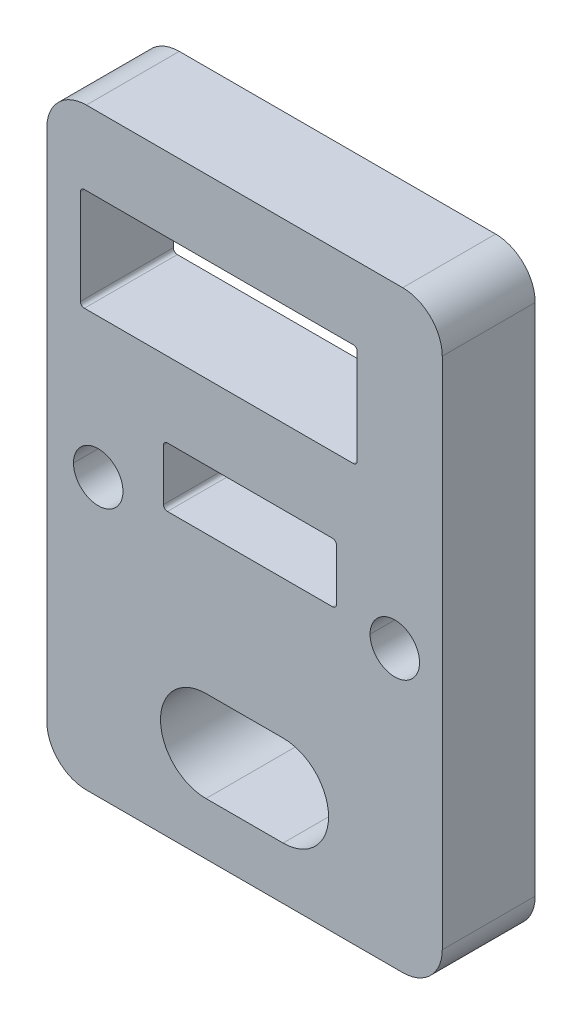
ISO-10303-21;
HEADER;
FILE_DESCRIPTION(('STEP AP214'),'2;1');
FILE_NAME('part.step','',(''),(''),'','','');
FILE_SCHEMA(('AUTOMOTIVE_DESIGN { 1 0 10303 214 1 1 1 1 }'));
ENDSEC;
DATA;
#1=APPLICATION_CONTEXT('core data for automotive mechanical design processes');
#2=APPLICATION_PROTOCOL_DEFINITION('international standard','automotive_design',2000,#1);
#3=PRODUCT_CONTEXT('',#1,'mechanical');
#4=PRODUCT('Part','Part','',(#3));
#5=PRODUCT_RELATED_PRODUCT_CATEGORY('part','',(#4));
#6=PRODUCT_DEFINITION_FORMATION('','',#4);
#7=PRODUCT_DEFINITION_CONTEXT('part definition',#1,'design');
#8=PRODUCT_DEFINITION('design','',#6,#7);
#9=PRODUCT_DEFINITION_SHAPE('','',#8);
#10=(LENGTH_UNIT() NAMED_UNIT(*) SI_UNIT(.MILLI.,.METRE.));
#11=(NAMED_UNIT(*) PLANE_ANGLE_UNIT() SI_UNIT($,.RADIAN.));
#12=(NAMED_UNIT(*) SI_UNIT($,.STERADIAN.) SOLID_ANGLE_UNIT());
#13=UNCERTAINTY_MEASURE_WITH_UNIT(LENGTH_MEASURE(1.E-05),#10,'distance_accuracy_value','');
#14=(GEOMETRIC_REPRESENTATION_CONTEXT(3) GLOBAL_UNCERTAINTY_ASSIGNED_CONTEXT((#13)) GLOBAL_UNIT_ASSIGNED_CONTEXT((#10,
#11,#12)) REPRESENTATION_CONTEXT('',''));
#15=CARTESIAN_POINT('',(0.,0.,0.));
#16=DIRECTION('',(0.,0.,1.));
#17=DIRECTION('',(1.,0.,0.));
#18=AXIS2_PLACEMENT_3D('',#15,#16,#17);
#19=CARTESIAN_POINT('',(18.5,-6.,-4.7));
#20=DIRECTION('',(0.,0.,-1.));
#21=DIRECTION('',(-1.,0.,0.));
#22=AXIS2_PLACEMENT_3D('',#19,#20,#21);
#23=CYLINDRICAL_SURFACE('',#22,2.);
#24=CARTESIAN_POINT('',(18.5,-6.,-4.7));
#25=DIRECTION('',(0.,0.,-1.));
#26=DIRECTION('',(-1.,0.,0.));
#27=AXIS2_PLACEMENT_3D('',#24,#25,#26);
#28=CIRCLE('',#27,2.);
#29=CARTESIAN_POINT('',(20.5,-6.,-4.7));
#30=VERTEX_POINT('',#29);
#31=CARTESIAN_POINT('',(18.5,-8.,-4.7));
#32=VERTEX_POINT('',#31);
#33=EDGE_CURVE('E493',#30,#32,#28,.T.);
#34=ORIENTED_EDGE('',*,*,#33,.F.);
#35=DIRECTION('',(0.,0.,-1.));
#36=VECTOR('',#35,1.);
#37=CARTESIAN_POINT('',(20.5,-6.,-4.7));
#38=LINE('',#37,#36);
#39=CARTESIAN_POINT('',(20.5,-6.,0.));
#40=VERTEX_POINT('',#39);
#41=EDGE_CURVE('E606',#40,#30,#38,.T.);
#42=ORIENTED_EDGE('',*,*,#41,.F.);
#43=CARTESIAN_POINT('',(18.5,-6.,0.));
#44=DIRECTION('',(0.,0.,1.));
#45=DIRECTION('',(-1.,0.,0.));
#46=AXIS2_PLACEMENT_3D('',#43,#44,#45);
#47=CIRCLE('',#46,2.);
#48=CARTESIAN_POINT('',(18.5,-8.,0.));
#49=VERTEX_POINT('',#48);
#50=EDGE_CURVE('E363',#49,#40,#47,.T.);
#51=ORIENTED_EDGE('',*,*,#50,.F.);
#52=DIRECTION('',(0.,0.,1.));
#53=VECTOR('',#52,1.);
#54=CARTESIAN_POINT('',(18.5,-8.,0.));
#55=LINE('',#54,#53);
#56=EDGE_CURVE('E342',#32,#49,#55,.T.);
#57=ORIENTED_EDGE('',*,*,#56,.F.);
#58=EDGE_LOOP('',(#34,#42,#51,#57));
#59=FACE_BOUND('',#58,.T.);
#60=ADVANCED_FACE('F17',(#59),#23,.T.);
#61=CARTESIAN_POINT('',(18.5,20.,-4.7));
#62=DIRECTION('',(0.,0.,1.));
#63=DIRECTION('',(1.,0.,0.));
#64=AXIS2_PLACEMENT_3D('',#61,#62,#63);
#65=CYLINDRICAL_SURFACE('',#64,2.);
#66=CARTESIAN_POINT('',(18.5,20.,-4.7));
#67=DIRECTION('',(0.,0.,-1.));
#68=DIRECTION('',(-1.,0.,0.));
#69=AXIS2_PLACEMENT_3D('',#66,#67,#68);
#70=CIRCLE('',#69,2.);
#71=CARTESIAN_POINT('',(18.5,22.,-4.7));
#72=VERTEX_POINT('',#71);
#73=CARTESIAN_POINT('',(20.5,20.,-4.7));
#74=VERTEX_POINT('',#73);
#75=EDGE_CURVE('E499',#72,#74,#70,.T.);
#76=ORIENTED_EDGE('',*,*,#75,.F.);
#77=DIRECTION('',(0.,0.,-1.));
#78=VECTOR('',#77,1.);
#79=CARTESIAN_POINT('',(18.5,22.,-4.7));
#80=LINE('',#79,#78);
#81=CARTESIAN_POINT('',(18.5,22.,0.));
#82=VERTEX_POINT('',#81);
#83=EDGE_CURVE('E637',#82,#72,#80,.T.);
#84=ORIENTED_EDGE('',*,*,#83,.F.);
#85=CARTESIAN_POINT('',(18.5,20.,0.));
#86=DIRECTION('',(0.,0.,1.));
#87=DIRECTION('',(-1.,0.,0.));
#88=AXIS2_PLACEMENT_3D('',#85,#86,#87);
#89=CIRCLE('',#88,2.);
#90=CARTESIAN_POINT('',(20.5,20.,0.));
#91=VERTEX_POINT('',#90);
#92=EDGE_CURVE('E357',#91,#82,#89,.T.);
#93=ORIENTED_EDGE('',*,*,#92,.F.);
#94=DIRECTION('',(0.,0.,1.));
#95=VECTOR('',#94,1.);
#96=CARTESIAN_POINT('',(20.5,20.,-4.7));
#97=LINE('',#96,#95);
#98=EDGE_CURVE('E627',#74,#91,#97,.T.);
#99=ORIENTED_EDGE('',*,*,#98,.F.);
#100=EDGE_LOOP('',(#76,#84,#93,#99));
#101=FACE_BOUND('',#100,.T.);
#102=ADVANCED_FACE('F628',(#101),#65,.T.);
#103=CARTESIAN_POINT('',(2.5,-6.,-4.7));
#104=DIRECTION('',(0.,0.,1.));
#105=DIRECTION('',(1.,0.,0.));
#106=AXIS2_PLACEMENT_3D('',#103,#104,#105);
#107=CYLINDRICAL_SURFACE('',#106,2.);
#108=CARTESIAN_POINT('',(2.5,-6.,-4.7));
#109=DIRECTION('',(0.,0.,-1.));
#110=DIRECTION('',(-1.,0.,0.));
#111=AXIS2_PLACEMENT_3D('',#108,#109,#110);
#112=CIRCLE('',#111,2.);
#113=CARTESIAN_POINT('',(2.5,-8.,-4.7));
#114=VERTEX_POINT('',#113);
#115=CARTESIAN_POINT('',(0.500000000000006,-6.,-4.7));
#116=VERTEX_POINT('',#115);
#117=EDGE_CURVE('E484',#114,#116,#112,.T.);
#118=ORIENTED_EDGE('',*,*,#117,.F.);
#119=DIRECTION('',(0.,0.,-1.));
#120=VECTOR('',#119,1.);
#121=CARTESIAN_POINT('',(2.5,-8.,-4.7));
#122=LINE('',#121,#120);
#123=CARTESIAN_POINT('',(2.5,-8.,0.));
#124=VERTEX_POINT('',#123);
#125=EDGE_CURVE('E20',#124,#114,#122,.T.);
#126=ORIENTED_EDGE('',*,*,#125,.F.);
#127=CARTESIAN_POINT('',(2.5,-6.,0.));
#128=DIRECTION('',(0.,0.,1.));
#129=DIRECTION('',(-1.,0.,0.));
#130=AXIS2_PLACEMENT_3D('',#127,#128,#129);
#131=CIRCLE('',#130,2.);
#132=CARTESIAN_POINT('',(0.500000000000006,-6.,0.));
#133=VERTEX_POINT('',#132);
#134=EDGE_CURVE('E523',#133,#124,#131,.T.);
#135=ORIENTED_EDGE('',*,*,#134,.F.);
#136=DIRECTION('',(0.,0.,1.));
#137=VECTOR('',#136,1.);
#138=CARTESIAN_POINT('',(0.500000000000006,-6.,-4.7));
#139=LINE('',#138,#137);
#140=EDGE_CURVE('E460',#116,#133,#139,.T.);
#141=ORIENTED_EDGE('',*,*,#140,.F.);
#142=EDGE_LOOP('',(#118,#126,#135,#141));
#143=FACE_BOUND('',#142,.T.);
#144=ADVANCED_FACE('F485',(#143),#107,.T.);
#145=CARTESIAN_POINT('',(2.5,20.,-4.7));
#146=DIRECTION('',(0.,0.,-1.));
#147=DIRECTION('',(-1.,0.,0.));
#148=AXIS2_PLACEMENT_3D('',#145,#146,#147);
#149=CYLINDRICAL_SURFACE('',#148,2.);
#150=CARTESIAN_POINT('',(2.5,20.,-4.7));
#151=DIRECTION('',(0.,0.,-1.));
#152=DIRECTION('',(-1.,0.,0.));
#153=AXIS2_PLACEMENT_3D('',#150,#151,#152);
#154=CIRCLE('',#153,2.);
#155=CARTESIAN_POINT('',(0.500000000000006,20.,-4.7));
#156=VERTEX_POINT('',#155);
#157=CARTESIAN_POINT('',(2.5,22.,-4.7));
#158=VERTEX_POINT('',#157);
#159=EDGE_CURVE('E597',#156,#158,#154,.T.);
#160=ORIENTED_EDGE('',*,*,#159,.F.);
#161=DIRECTION('',(0.,0.,-1.));
#162=VECTOR('',#161,1.);
#163=CARTESIAN_POINT('',(0.500000000000006,20.,-4.7));
#164=LINE('',#163,#162);
#165=CARTESIAN_POINT('',(0.500000000000006,20.,0.));
#166=VERTEX_POINT('',#165);
#167=EDGE_CURVE('E458',#166,#156,#164,.T.);
#168=ORIENTED_EDGE('',*,*,#167,.F.);
#169=CARTESIAN_POINT('',(2.5,20.,0.));
#170=DIRECTION('',(0.,0.,1.));
#171=DIRECTION('',(-1.,0.,0.));
#172=AXIS2_PLACEMENT_3D('',#169,#170,#171);
#173=CIRCLE('',#172,2.);
#174=CARTESIAN_POINT('',(2.5,22.,0.));
#175=VERTEX_POINT('',#174);
#176=EDGE_CURVE('E524',#175,#166,#173,.T.);
#177=ORIENTED_EDGE('',*,*,#176,.F.);
#178=DIRECTION('',(0.,0.,1.));
#179=VECTOR('',#178,1.);
#180=CARTESIAN_POINT('',(2.5,22.,0.));
#181=LINE('',#180,#179);
#182=EDGE_CURVE('E600',#158,#175,#181,.T.);
#183=ORIENTED_EDGE('',*,*,#182,.F.);
#184=EDGE_LOOP('',(#160,#168,#177,#183));
#185=FACE_BOUND('',#184,.T.);
#186=ADVANCED_FACE('F598',(#185),#149,.T.);
#187=CARTESIAN_POINT('',(8.55,-5.35,-4.7));
#188=DIRECTION('',(0.,-1.,0.));
#189=DIRECTION('',(0.,0.,-1.));
#190=AXIS2_PLACEMENT_3D('',#187,#188,#189);
#191=PLANE('',#190);
#192=DIRECTION('',(1.,0.,0.));
#193=VECTOR('',#192,1.);
#194=CARTESIAN_POINT('',(8.55,-5.35,0.));
#195=LINE('',#194,#193);
#196=CARTESIAN_POINT('',(8.55,-5.35,0.));
#197=VERTEX_POINT('',#196);
#198=CARTESIAN_POINT('',(12.45,-5.35,0.));
#199=VERTEX_POINT('',#198);
#200=EDGE_CURVE('E337',#197,#199,#195,.T.);
#201=ORIENTED_EDGE('',*,*,#200,.T.);
#202=DIRECTION('',(0.,0.,1.));
#203=VECTOR('',#202,1.);
#204=CARTESIAN_POINT('',(12.45,-5.35,-4.7));
#205=LINE('',#204,#203);
#206=CARTESIAN_POINT('',(12.45,-5.35,-4.7));
#207=VERTEX_POINT('',#206);
#208=EDGE_CURVE('E11',#207,#199,#205,.T.);
#209=ORIENTED_EDGE('',*,*,#208,.F.);
#210=DIRECTION('',(1.,0.,0.));
#211=VECTOR('',#210,1.);
#212=CARTESIAN_POINT('',(8.55,-5.35,-4.7));
#213=LINE('',#212,#211);
#214=CARTESIAN_POINT('',(8.55,-5.35,-4.7));
#215=VERTEX_POINT('',#214);
#216=EDGE_CURVE('E339',#215,#207,#213,.T.);
#217=ORIENTED_EDGE('',*,*,#216,.F.);
#218=DIRECTION('',(0.,0.,1.));
#219=VECTOR('',#218,1.);
#220=CARTESIAN_POINT('',(8.55,-5.35,-4.7));
#221=LINE('',#220,#219);
#222=EDGE_CURVE('E334',#215,#197,#221,.T.);
#223=ORIENTED_EDGE('',*,*,#222,.T.);
#224=EDGE_LOOP('',(#201,#209,#217,#223));
#225=FACE_BOUND('',#224,.T.);
#226=ADVANCED_FACE('F335',(#225),#191,.F.);
#227=CARTESIAN_POINT('',(12.45,-3.05,-4.7));
#228=DIRECTION('',(0.,0.,1.));
#229=DIRECTION('',(1.,0.,0.));
#230=AXIS2_PLACEMENT_3D('',#227,#228,#229);
#231=CYLINDRICAL_SURFACE('',#230,2.3);
#232=DIRECTION('',(0.,0.,1.));
#233=VECTOR('',#232,1.);
#234=CARTESIAN_POINT('',(14.75,-3.05,-4.7));
#235=LINE('',#234,#233);
#236=CARTESIAN_POINT('',(14.75,-3.05,-4.7));
#237=VERTEX_POINT('',#236);
#238=CARTESIAN_POINT('',(14.75,-3.05,0.));
#239=VERTEX_POINT('',#238);
#240=EDGE_CURVE('E785',#237,#239,#235,.T.);
#241=ORIENTED_EDGE('',*,*,#240,.F.);
#242=CARTESIAN_POINT('',(12.45,-3.05,-4.7));
#243=DIRECTION('',(0.,0.,1.));
#244=DIRECTION('',(1.,0.,0.));
#245=AXIS2_PLACEMENT_3D('',#242,#243,#244);
#246=CIRCLE('',#245,2.3);
#247=EDGE_CURVE('E511',#207,#237,#246,.T.);
#248=ORIENTED_EDGE('',*,*,#247,.F.);
#249=ORIENTED_EDGE('',*,*,#208,.T.);
#250=CARTESIAN_POINT('',(12.45,-3.05,0.));
#251=DIRECTION('',(0.,0.,1.));
#252=DIRECTION('',(1.,0.,0.));
#253=AXIS2_PLACEMENT_3D('',#250,#251,#252);
#254=CIRCLE('',#253,2.3);
#255=EDGE_CURVE('E355',#199,#239,#254,.T.);
#256=ORIENTED_EDGE('',*,*,#255,.T.);
#257=EDGE_LOOP('',(#241,#248,#249,#256));
#258=FACE_BOUND('',#257,.T.);
#259=ADVANCED_FACE('F670',(#258),#231,.F.);
#260=CARTESIAN_POINT('',(8.55,-0.75,-4.7));
#261=DIRECTION('',(0.,1.,0.));
#262=DIRECTION('',(1.,0.,0.));
#263=AXIS2_PLACEMENT_3D('',#260,#261,#262);
#264=PLANE('',#263);
#265=DIRECTION('',(-1.,0.,0.));
#266=VECTOR('',#265,1.);
#267=CARTESIAN_POINT('',(8.55,-0.75,0.));
#268=LINE('',#267,#266);
#269=CARTESIAN_POINT('',(12.45,-0.75,0.));
#270=VERTEX_POINT('',#269);
#271=CARTESIAN_POINT('',(8.55,-0.75,0.));
#272=VERTEX_POINT('',#271);
#273=EDGE_CURVE('E349',#270,#272,#268,.T.);
#274=ORIENTED_EDGE('',*,*,#273,.T.);
#275=DIRECTION('',(0.,0.,1.));
#276=VECTOR('',#275,1.);
#277=CARTESIAN_POINT('',(8.55,-0.75,-4.7));
#278=LINE('',#277,#276);
#279=CARTESIAN_POINT('',(8.55,-0.75,-4.7));
#280=VERTEX_POINT('',#279);
#281=EDGE_CURVE('E27',#280,#272,#278,.T.);
#282=ORIENTED_EDGE('',*,*,#281,.F.);
#283=DIRECTION('',(-1.,0.,0.));
#284=VECTOR('',#283,1.);
#285=CARTESIAN_POINT('',(8.55,-0.75,-4.7));
#286=LINE('',#285,#284);
#287=CARTESIAN_POINT('',(12.45,-0.75,-4.7));
#288=VERTEX_POINT('',#287);
#289=EDGE_CURVE('E514',#288,#280,#286,.T.);
#290=ORIENTED_EDGE('',*,*,#289,.F.);
#291=DIRECTION('',(0.,0.,1.));
#292=VECTOR('',#291,1.);
#293=CARTESIAN_POINT('',(12.45,-0.75,-4.7));
#294=LINE('',#293,#292);
#295=EDGE_CURVE('E787',#288,#270,#294,.T.);
#296=ORIENTED_EDGE('',*,*,#295,.T.);
#297=EDGE_LOOP('',(#274,#282,#290,#296));
#298=FACE_BOUND('',#297,.T.);
#299=ADVANCED_FACE('F673',(#298),#264,.F.);
#300=CARTESIAN_POINT('',(8.55,-3.05,-4.7));
#301=DIRECTION('',(0.,0.,1.));
#302=DIRECTION('',(1.,0.,0.));
#303=AXIS2_PLACEMENT_3D('',#300,#301,#302);
#304=CYLINDRICAL_SURFACE('',#303,2.3);
#305=CARTESIAN_POINT('',(8.55,-3.05,0.));
#306=DIRECTION('',(0.,0.,1.));
#307=DIRECTION('',(1.,0.,0.));
#308=AXIS2_PLACEMENT_3D('',#305,#306,#307);
#309=CIRCLE('',#308,2.3);
#310=EDGE_CURVE('E345',#272,#197,#309,.T.);
#311=ORIENTED_EDGE('',*,*,#310,.T.);
#312=ORIENTED_EDGE('',*,*,#222,.F.);
#313=CARTESIAN_POINT('',(8.55,-3.05,-4.7));
#314=DIRECTION('',(0.,0.,1.));
#315=DIRECTION('',(1.,0.,0.));
#316=AXIS2_PLACEMENT_3D('',#313,#314,#315);
#317=CIRCLE('',#316,2.3);
#318=EDGE_CURVE('E489',#280,#215,#317,.T.);
#319=ORIENTED_EDGE('',*,*,#318,.F.);
#320=ORIENTED_EDGE('',*,*,#281,.T.);
#321=EDGE_LOOP('',(#311,#312,#319,#320));
#322=FACE_BOUND('',#321,.T.);
#323=ADVANCED_FACE('F346',(#322),#304,.F.);
#324=CARTESIAN_POINT('',(0.500000000000007,-8.,-4.7));
#325=DIRECTION('',(0.,1.,0.));
#326=DIRECTION('',(1.,0.,0.));
#327=AXIS2_PLACEMENT_3D('',#324,#325,#326);
#328=PLANE('',#327);
#329=DIRECTION('',(-1.,0.,0.));
#330=VECTOR('',#329,1.);
#331=CARTESIAN_POINT('',(0.500000000000007,-8.,0.));
#332=LINE('',#331,#330);
#333=EDGE_CURVE('E480',#49,#124,#332,.T.);
#334=ORIENTED_EDGE('',*,*,#333,.T.);
#335=ORIENTED_EDGE('',*,*,#125,.T.);
#336=DIRECTION('',(-1.,0.,0.));
#337=VECTOR('',#336,1.);
#338=CARTESIAN_POINT('',(0.500000000000007,-8.,-4.7));
#339=LINE('',#338,#337);
#340=EDGE_CURVE('E477',#32,#114,#339,.T.);
#341=ORIENTED_EDGE('',*,*,#340,.F.);
#342=ORIENTED_EDGE('',*,*,#56,.T.);
#343=EDGE_LOOP('',(#334,#335,#341,#342));
#344=FACE_BOUND('',#343,.T.);
#345=ADVANCED_FACE('F475',(#344),#328,.F.);
#346=CARTESIAN_POINT('',(0.500000000000006,22.,-4.7));
#347=DIRECTION('',(1.,0.,0.));
#348=DIRECTION('',(0.,1.,0.));
#349=AXIS2_PLACEMENT_3D('',#346,#347,#348);
#350=PLANE('',#349);
#351=DIRECTION('',(0.,-1.,0.));
#352=VECTOR('',#351,1.);
#353=CARTESIAN_POINT('',(0.500000000000006,0.,0.));
#354=LINE('',#353,#352);
#355=EDGE_CURVE('E519',#166,#133,#354,.T.);
#356=ORIENTED_EDGE('',*,*,#355,.F.);
#357=ORIENTED_EDGE('',*,*,#167,.T.);
#358=DIRECTION('',(0.,1.,0.));
#359=VECTOR('',#358,1.);
#360=CARTESIAN_POINT('',(0.500000000000006,22.,-4.7));
#361=LINE('',#360,#359);
#362=EDGE_CURVE('E594',#116,#156,#361,.T.);
#363=ORIENTED_EDGE('',*,*,#362,.F.);
#364=ORIENTED_EDGE('',*,*,#140,.T.);
#365=EDGE_LOOP('',(#356,#357,#363,#364));
#366=FACE_BOUND('',#365,.T.);
#367=ADVANCED_FACE('F592',(#366),#350,.F.);
#368=CARTESIAN_POINT('',(2.4,13.25,-4.7));
#369=DIRECTION('',(0.,0.,-1.));
#370=DIRECTION('',(-1.,0.,0.));
#371=AXIS2_PLACEMENT_3D('',#368,#369,#370);
#372=CYLINDRICAL_SURFACE('',#371,0.2);
#373=CARTESIAN_POINT('',(2.4,13.25,-4.7));
#374=DIRECTION('',(0.,0.,1.));
#375=DIRECTION('',(-1.,0.,0.));
#376=AXIS2_PLACEMENT_3D('',#373,#374,#375);
#377=CIRCLE('',#376,0.2);
#378=CARTESIAN_POINT('',(2.2,13.25,-4.7));
#379=VERTEX_POINT('',#378);
#380=CARTESIAN_POINT('',(2.4,13.05,-4.7));
#381=VERTEX_POINT('',#380);
#382=EDGE_CURVE('E571',#379,#381,#377,.T.);
#383=ORIENTED_EDGE('',*,*,#382,.F.);
#384=DIRECTION('',(0.,0.,-1.));
#385=VECTOR('',#384,1.);
#386=CARTESIAN_POINT('',(2.2,13.25,-4.7));
#387=LINE('',#386,#385);
#388=CARTESIAN_POINT('',(2.2,13.25,0.));
#389=VERTEX_POINT('',#388);
#390=EDGE_CURVE('E444',#389,#379,#387,.T.);
#391=ORIENTED_EDGE('',*,*,#390,.F.);
#392=CARTESIAN_POINT('',(2.4,13.25,0.));
#393=DIRECTION('',(0.,0.,-1.));
#394=DIRECTION('',(-1.,0.,0.));
#395=AXIS2_PLACEMENT_3D('',#392,#393,#394);
#396=CIRCLE('',#395,0.2);
#397=CARTESIAN_POINT('',(2.4,13.05,0.));
#398=VERTEX_POINT('',#397);
#399=EDGE_CURVE('E420',#398,#389,#396,.T.);
#400=ORIENTED_EDGE('',*,*,#399,.F.);
#401=DIRECTION('',(0.,0.,1.));
#402=VECTOR('',#401,1.);
#403=CARTESIAN_POINT('',(2.4,13.05,0.));
#404=LINE('',#403,#402);
#405=EDGE_CURVE('E367',#381,#398,#404,.T.);
#406=ORIENTED_EDGE('',*,*,#405,.F.);
#407=EDGE_LOOP('',(#383,#391,#400,#406));
#408=FACE_BOUND('',#407,.T.);
#409=ADVANCED_FACE('F684',(#408),#372,.F.);
#410=CARTESIAN_POINT('',(2.4,18.05,-4.7));
#411=DIRECTION('',(0.,0.,-1.));
#412=DIRECTION('',(-1.,0.,0.));
#413=AXIS2_PLACEMENT_3D('',#410,#411,#412);
#414=CYLINDRICAL_SURFACE('',#413,0.2);
#415=CARTESIAN_POINT('',(2.4,18.05,-4.7));
#416=DIRECTION('',(0.,0.,1.));
#417=DIRECTION('',(-1.,0.,0.));
#418=AXIS2_PLACEMENT_3D('',#415,#416,#417);
#419=CIRCLE('',#418,0.2);
#420=CARTESIAN_POINT('',(2.4,18.25,-4.7));
#421=VERTEX_POINT('',#420);
#422=CARTESIAN_POINT('',(2.2,18.05,-4.7));
#423=VERTEX_POINT('',#422);
#424=EDGE_CURVE('E561',#421,#423,#419,.T.);
#425=ORIENTED_EDGE('',*,*,#424,.F.);
#426=DIRECTION('',(0.,0.,-1.));
#427=VECTOR('',#426,1.);
#428=CARTESIAN_POINT('',(2.4,18.25,-4.7));
#429=LINE('',#428,#427);
#430=CARTESIAN_POINT('',(2.4,18.25,0.));
#431=VERTEX_POINT('',#430);
#432=EDGE_CURVE('E92',#431,#421,#429,.T.);
#433=ORIENTED_EDGE('',*,*,#432,.F.);
#434=CARTESIAN_POINT('',(2.4,18.05,0.));
#435=DIRECTION('',(0.,0.,-1.));
#436=DIRECTION('',(-1.,0.,0.));
#437=AXIS2_PLACEMENT_3D('',#434,#435,#436);
#438=CIRCLE('',#437,0.2);
#439=CARTESIAN_POINT('',(2.2,18.05,0.));
#440=VERTEX_POINT('',#439);
#441=EDGE_CURVE('E425',#440,#431,#438,.T.);
#442=ORIENTED_EDGE('',*,*,#441,.F.);
#443=DIRECTION('',(0.,0.,1.));
#444=VECTOR('',#443,1.);
#445=CARTESIAN_POINT('',(2.2,18.05,0.));
#446=LINE('',#445,#444);
#447=EDGE_CURVE('E441',#423,#440,#446,.T.);
#448=ORIENTED_EDGE('',*,*,#447,.F.);
#449=EDGE_LOOP('',(#425,#433,#442,#448));
#450=FACE_BOUND('',#449,.T.);
#451=ADVANCED_FACE('F687',(#450),#414,.F.);
#452=CARTESIAN_POINT('',(16.,18.05,-4.7));
#453=DIRECTION('',(0.,0.,-1.));
#454=DIRECTION('',(-1.,0.,0.));
#455=AXIS2_PLACEMENT_3D('',#452,#453,#454);
#456=CYLINDRICAL_SURFACE('',#455,0.2);
#457=CARTESIAN_POINT('',(16.,18.05,-4.7));
#458=DIRECTION('',(0.,0.,1.));
#459=DIRECTION('',(-1.,0.,0.));
#460=AXIS2_PLACEMENT_3D('',#457,#458,#459);
#461=CIRCLE('',#460,0.2);
#462=CARTESIAN_POINT('',(16.2,18.05,-4.7));
#463=VERTEX_POINT('',#462);
#464=CARTESIAN_POINT('',(16.,18.25,-4.7));
#465=VERTEX_POINT('',#464);
#466=EDGE_CURVE('E582',#463,#465,#461,.T.);
#467=ORIENTED_EDGE('',*,*,#466,.F.);
#468=DIRECTION('',(0.,0.,-1.));
#469=VECTOR('',#468,1.);
#470=CARTESIAN_POINT('',(16.2,18.05,-4.7));
#471=LINE('',#470,#469);
#472=CARTESIAN_POINT('',(16.2,18.05,0.));
#473=VERTEX_POINT('',#472);
#474=EDGE_CURVE('E447',#473,#463,#471,.T.);
#475=ORIENTED_EDGE('',*,*,#474,.F.);
#476=CARTESIAN_POINT('',(16.,18.05,0.));
#477=DIRECTION('',(0.,0.,-1.));
#478=DIRECTION('',(-1.,0.,0.));
#479=AXIS2_PLACEMENT_3D('',#476,#477,#478);
#480=CIRCLE('',#479,0.2);
#481=CARTESIAN_POINT('',(16.,18.25,0.));
#482=VERTEX_POINT('',#481);
#483=EDGE_CURVE('E434',#482,#473,#480,.T.);
#484=ORIENTED_EDGE('',*,*,#483,.F.);
#485=DIRECTION('',(0.,0.,1.));
#486=VECTOR('',#485,1.);
#487=CARTESIAN_POINT('',(16.,18.25,0.));
#488=LINE('',#487,#486);
#489=EDGE_CURVE('E79',#465,#482,#488,.T.);
#490=ORIENTED_EDGE('',*,*,#489,.F.);
#491=EDGE_LOOP('',(#467,#475,#484,#490));
#492=FACE_BOUND('',#491,.T.);
#493=ADVANCED_FACE('F691',(#492),#456,.F.);
#494=CARTESIAN_POINT('',(16.,13.25,-4.7));
#495=DIRECTION('',(0.,0.,-1.));
#496=DIRECTION('',(-1.,0.,0.));
#497=AXIS2_PLACEMENT_3D('',#494,#495,#496);
#498=CYLINDRICAL_SURFACE('',#497,0.2);
#499=CARTESIAN_POINT('',(16.,13.25,-4.7));
#500=DIRECTION('',(0.,0.,1.));
#501=DIRECTION('',(-1.,0.,0.));
#502=AXIS2_PLACEMENT_3D('',#499,#500,#501);
#503=CIRCLE('',#502,0.2);
#504=CARTESIAN_POINT('',(16.,13.05,-4.7));
#505=VERTEX_POINT('',#504);
#506=CARTESIAN_POINT('',(16.2,13.25,-4.7));
#507=VERTEX_POINT('',#506);
#508=EDGE_CURVE('E502',#505,#507,#503,.T.);
#509=ORIENTED_EDGE('',*,*,#508,.F.);
#510=DIRECTION('',(0.,0.,-1.));
#511=VECTOR('',#510,1.);
#512=CARTESIAN_POINT('',(16.,13.05,-4.7));
#513=LINE('',#512,#511);
#514=CARTESIAN_POINT('',(16.,13.05,0.));
#515=VERTEX_POINT('',#514);
#516=EDGE_CURVE('E371',#515,#505,#513,.T.);
#517=ORIENTED_EDGE('',*,*,#516,.F.);
#518=CARTESIAN_POINT('',(16.,13.25,0.));
#519=DIRECTION('',(0.,0.,-1.));
#520=DIRECTION('',(-1.,0.,0.));
#521=AXIS2_PLACEMENT_3D('',#518,#519,#520);
#522=CIRCLE('',#521,0.2);
#523=CARTESIAN_POINT('',(16.2,13.25,0.));
#524=VERTEX_POINT('',#523);
#525=EDGE_CURVE('E433',#524,#515,#522,.T.);
#526=ORIENTED_EDGE('',*,*,#525,.F.);
#527=DIRECTION('',(0.,0.,1.));
#528=VECTOR('',#527,1.);
#529=CARTESIAN_POINT('',(16.2,13.25,0.));
#530=LINE('',#529,#528);
#531=EDGE_CURVE('E41',#507,#524,#530,.T.);
#532=ORIENTED_EDGE('',*,*,#531,.F.);
#533=EDGE_LOOP('',(#509,#517,#526,#532));
#534=FACE_BOUND('',#533,.T.);
#535=ADVANCED_FACE('F694',(#534),#498,.F.);
#536=CARTESIAN_POINT('',(14.95,6.45,-4.7));
#537=DIRECTION('',(0.,0.,-1.));
#538=DIRECTION('',(-1.,0.,0.));
#539=AXIS2_PLACEMENT_3D('',#536,#537,#538);
#540=CYLINDRICAL_SURFACE('',#539,0.2);
#541=CARTESIAN_POINT('',(14.95,6.45,-4.7));
#542=DIRECTION('',(0.,0.,1.));
#543=DIRECTION('',(-1.,0.,0.));
#544=AXIS2_PLACEMENT_3D('',#541,#542,#543);
#545=CIRCLE('',#544,0.2);
#546=CARTESIAN_POINT('',(14.95,6.25,-4.7));
#547=VERTEX_POINT('',#546);
#548=CARTESIAN_POINT('',(15.15,6.45,-4.7));
#549=VERTEX_POINT('',#548);
#550=EDGE_CURVE('E545',#547,#549,#545,.T.);
#551=ORIENTED_EDGE('',*,*,#550,.F.);
#552=DIRECTION('',(0.,0.,-1.));
#553=VECTOR('',#552,1.);
#554=CARTESIAN_POINT('',(14.95,6.25,-4.7));
#555=LINE('',#554,#553);
#556=CARTESIAN_POINT('',(14.95,6.25,0.));
#557=VERTEX_POINT('',#556);
#558=EDGE_CURVE('E105',#557,#547,#555,.T.);
#559=ORIENTED_EDGE('',*,*,#558,.F.);
#560=CARTESIAN_POINT('',(14.95,6.45,0.));
#561=DIRECTION('',(0.,0.,-1.));
#562=DIRECTION('',(-1.,0.,0.));
#563=AXIS2_PLACEMENT_3D('',#560,#561,#562);
#564=CIRCLE('',#563,0.2);
#565=CARTESIAN_POINT('',(15.15,6.45,0.));
#566=VERTEX_POINT('',#565);
#567=EDGE_CURVE('E413',#566,#557,#564,.T.);
#568=ORIENTED_EDGE('',*,*,#567,.F.);
#569=DIRECTION('',(0.,0.,1.));
#570=VECTOR('',#569,1.);
#571=CARTESIAN_POINT('',(15.15,6.45,0.));
#572=LINE('',#571,#570);
#573=EDGE_CURVE('E416',#549,#566,#572,.T.);
#574=ORIENTED_EDGE('',*,*,#573,.F.);
#575=EDGE_LOOP('',(#551,#559,#568,#574));
#576=FACE_BOUND('',#575,.T.);
#577=ADVANCED_FACE('F698',(#576),#540,.F.);
#578=CARTESIAN_POINT('',(6.6,6.45,-4.7));
#579=DIRECTION('',(0.,0.,-1.));
#580=DIRECTION('',(-1.,0.,0.));
#581=AXIS2_PLACEMENT_3D('',#578,#579,#580);
#582=CYLINDRICAL_SURFACE('',#581,0.2);
#583=CARTESIAN_POINT('',(6.6,6.45,-4.7));
#584=DIRECTION('',(0.,0.,1.));
#585=DIRECTION('',(-1.,0.,0.));
#586=AXIS2_PLACEMENT_3D('',#583,#584,#585);
#587=CIRCLE('',#586,0.2);
#588=CARTESIAN_POINT('',(6.4,6.45,-4.7));
#589=VERTEX_POINT('',#588);
#590=CARTESIAN_POINT('',(6.6,6.25,-4.7));
#591=VERTEX_POINT('',#590);
#592=EDGE_CURVE('E540',#589,#591,#587,.T.);
#593=ORIENTED_EDGE('',*,*,#592,.F.);
#594=DIRECTION('',(0.,0.,-1.));
#595=VECTOR('',#594,1.);
#596=CARTESIAN_POINT('',(6.4,6.45,-4.7));
#597=LINE('',#596,#595);
#598=CARTESIAN_POINT('',(6.4,6.45,0.));
#599=VERTEX_POINT('',#598);
#600=EDGE_CURVE('E406',#599,#589,#597,.T.);
#601=ORIENTED_EDGE('',*,*,#600,.F.);
#602=CARTESIAN_POINT('',(6.6,6.45,0.));
#603=DIRECTION('',(0.,0.,-1.));
#604=DIRECTION('',(-1.,0.,0.));
#605=AXIS2_PLACEMENT_3D('',#602,#603,#604);
#606=CIRCLE('',#605,0.2);
#607=CARTESIAN_POINT('',(6.6,6.25,0.));
#608=VERTEX_POINT('',#607);
#609=EDGE_CURVE('E383',#608,#599,#606,.T.);
#610=ORIENTED_EDGE('',*,*,#609,.F.);
#611=DIRECTION('',(0.,0.,1.));
#612=VECTOR('',#611,1.);
#613=CARTESIAN_POINT('',(6.6,6.25,0.));
#614=LINE('',#613,#612);
#615=EDGE_CURVE('E119',#591,#608,#614,.T.);
#616=ORIENTED_EDGE('',*,*,#615,.F.);
#617=EDGE_LOOP('',(#593,#601,#610,#616));
#618=FACE_BOUND('',#617,.T.);
#619=ADVANCED_FACE('F702',(#618),#582,.F.);
#620=CARTESIAN_POINT('',(6.6,9.05,-4.7));
#621=DIRECTION('',(0.,0.,-1.));
#622=DIRECTION('',(-1.,0.,0.));
#623=AXIS2_PLACEMENT_3D('',#620,#621,#622);
#624=CYLINDRICAL_SURFACE('',#623,0.2);
#625=CARTESIAN_POINT('',(6.6,9.05,-4.7));
#626=DIRECTION('',(0.,0.,1.));
#627=DIRECTION('',(-1.,0.,0.));
#628=AXIS2_PLACEMENT_3D('',#625,#626,#627);
#629=CIRCLE('',#628,0.2);
#630=CARTESIAN_POINT('',(6.6,9.25,-4.7));
#631=VERTEX_POINT('',#630);
#632=CARTESIAN_POINT('',(6.4,9.05,-4.7));
#633=VERTEX_POINT('',#632);
#634=EDGE_CURVE('E528',#631,#633,#629,.T.);
#635=ORIENTED_EDGE('',*,*,#634,.F.);
#636=DIRECTION('',(0.,0.,-1.));
#637=VECTOR('',#636,1.);
#638=CARTESIAN_POINT('',(6.6,9.25,-4.7));
#639=LINE('',#638,#637);
#640=CARTESIAN_POINT('',(6.6,9.25,0.));
#641=VERTEX_POINT('',#640);
#642=EDGE_CURVE('E437',#641,#631,#639,.T.);
#643=ORIENTED_EDGE('',*,*,#642,.F.);
#644=CARTESIAN_POINT('',(6.6,9.05,0.));
#645=DIRECTION('',(0.,0.,-1.));
#646=DIRECTION('',(-1.,0.,0.));
#647=AXIS2_PLACEMENT_3D('',#644,#645,#646);
#648=CIRCLE('',#647,0.2);
#649=CARTESIAN_POINT('',(6.4,9.05,0.));
#650=VERTEX_POINT('',#649);
#651=EDGE_CURVE('E391',#650,#641,#648,.T.);
#652=ORIENTED_EDGE('',*,*,#651,.F.);
#653=DIRECTION('',(0.,0.,1.));
#654=VECTOR('',#653,1.);
#655=CARTESIAN_POINT('',(6.4,9.05,0.));
#656=LINE('',#655,#654);
#657=EDGE_CURVE('E370',#633,#650,#656,.T.);
#658=ORIENTED_EDGE('',*,*,#657,.F.);
#659=EDGE_LOOP('',(#635,#643,#652,#658));
#660=FACE_BOUND('',#659,.T.);
#661=ADVANCED_FACE('F705',(#660),#624,.F.);
#662=CARTESIAN_POINT('',(14.95,9.05,-4.7));
#663=DIRECTION('',(0.,0.,-1.));
#664=DIRECTION('',(-1.,0.,0.));
#665=AXIS2_PLACEMENT_3D('',#662,#663,#664);
#666=CYLINDRICAL_SURFACE('',#665,0.2);
#667=CARTESIAN_POINT('',(14.95,9.05,-4.7));
#668=DIRECTION('',(0.,0.,1.));
#669=DIRECTION('',(-1.,0.,0.));
#670=AXIS2_PLACEMENT_3D('',#667,#668,#669);
#671=CIRCLE('',#670,0.2);
#672=CARTESIAN_POINT('',(15.15,9.05,-4.7));
#673=VERTEX_POINT('',#672);
#674=CARTESIAN_POINT('',(14.95,9.25,-4.7));
#675=VERTEX_POINT('',#674);
#676=EDGE_CURVE('E553',#673,#675,#671,.T.);
#677=ORIENTED_EDGE('',*,*,#676,.F.);
#678=DIRECTION('',(0.,0.,-1.));
#679=VECTOR('',#678,1.);
#680=CARTESIAN_POINT('',(15.15,9.05,-4.7));
#681=LINE('',#680,#679);
#682=CARTESIAN_POINT('',(15.15,9.05,0.));
#683=VERTEX_POINT('',#682);
#684=EDGE_CURVE('E453',#683,#673,#681,.T.);
#685=ORIENTED_EDGE('',*,*,#684,.F.);
#686=CARTESIAN_POINT('',(14.95,9.05,0.));
#687=DIRECTION('',(0.,0.,-1.));
#688=DIRECTION('',(-1.,0.,0.));
#689=AXIS2_PLACEMENT_3D('',#686,#687,#688);
#690=CIRCLE('',#689,0.2);
#691=CARTESIAN_POINT('',(14.95,9.25,0.));
#692=VERTEX_POINT('',#691);
#693=EDGE_CURVE('E399',#692,#683,#690,.T.);
#694=ORIENTED_EDGE('',*,*,#693,.F.);
#695=DIRECTION('',(0.,0.,1.));
#696=VECTOR('',#695,1.);
#697=CARTESIAN_POINT('',(14.95,9.25,0.));
#698=LINE('',#697,#696);
#699=EDGE_CURVE('E409',#675,#692,#698,.T.);
#700=ORIENTED_EDGE('',*,*,#699,.F.);
#701=EDGE_LOOP('',(#677,#685,#694,#700));
#702=FACE_BOUND('',#701,.T.);
#703=ADVANCED_FACE('F709',(#702),#666,.F.);
#704=CARTESIAN_POINT('',(18.1,6.,-4.7));
#705=DIRECTION('',(0.,0.,1.));
#706=DIRECTION('',(1.,0.,0.));
#707=AXIS2_PLACEMENT_3D('',#704,#705,#706);
#708=CYLINDRICAL_SURFACE('',#707,1.25);
#709=DIRECTION('',(0.,0.,1.));
#710=VECTOR('',#709,1.);
#711=CARTESIAN_POINT('',(16.85,6.,-4.7));
#712=LINE('',#711,#710);
#713=CARTESIAN_POINT('',(16.85,6.,-4.7));
#714=VERTEX_POINT('',#713);
#715=CARTESIAN_POINT('',(16.85,6.,0.));
#716=VERTEX_POINT('',#715);
#717=EDGE_CURVE('E825',#714,#716,#712,.T.);
#718=ORIENTED_EDGE('',*,*,#717,.F.);
#719=CARTESIAN_POINT('',(18.1,6.,-4.7));
#720=DIRECTION('',(0.,0.,1.));
#721=DIRECTION('',(1.,0.,0.));
#722=AXIS2_PLACEMENT_3D('',#719,#720,#721);
#723=CIRCLE('',#722,1.25);
#724=CARTESIAN_POINT('',(19.35,6.,-4.7));
#725=VERTEX_POINT('',#724);
#726=EDGE_CURVE('E518',#725,#714,#723,.T.);
#727=ORIENTED_EDGE('',*,*,#726,.F.);
#728=DIRECTION('',(0.,0.,1.));
#729=VECTOR('',#728,1.);
#730=CARTESIAN_POINT('',(19.35,6.,-4.7));
#731=LINE('',#730,#729);
#732=CARTESIAN_POINT('',(19.35,6.,0.));
#733=VERTEX_POINT('',#732);
#734=EDGE_CURVE('E802',#725,#733,#731,.T.);
#735=ORIENTED_EDGE('',*,*,#734,.T.);
#736=CARTESIAN_POINT('',(18.1,6.,0.));
#737=DIRECTION('',(0.,0.,1.));
#738=DIRECTION('',(1.,0.,0.));
#739=AXIS2_PLACEMENT_3D('',#736,#737,#738);
#740=CIRCLE('',#739,1.25);
#741=EDGE_CURVE('E376',#733,#716,#740,.T.);
#742=ORIENTED_EDGE('',*,*,#741,.T.);
#743=EDGE_LOOP('',(#718,#727,#735,#742));
#744=FACE_BOUND('',#743,.T.);
#745=ADVANCED_FACE('F711',(#744),#708,.F.);
#746=CARTESIAN_POINT('',(3.1,6.,-4.7));
#747=DIRECTION('',(0.,0.,1.));
#748=DIRECTION('',(1.,0.,0.));
#749=AXIS2_PLACEMENT_3D('',#746,#747,#748);
#750=CYLINDRICAL_SURFACE('',#749,1.25);
#751=DIRECTION('',(0.,0.,1.));
#752=VECTOR('',#751,1.);
#753=CARTESIAN_POINT('',(1.85,6.,-4.7));
#754=LINE('',#753,#752);
#755=CARTESIAN_POINT('',(1.85,6.,-4.7));
#756=VERTEX_POINT('',#755);
#757=CARTESIAN_POINT('',(1.85,6.,0.));
#758=VERTEX_POINT('',#757);
#759=EDGE_CURVE('E801',#756,#758,#754,.T.);
#760=ORIENTED_EDGE('',*,*,#759,.F.);
#761=CARTESIAN_POINT('',(3.1,6.,-4.7));
#762=DIRECTION('',(0.,0.,1.));
#763=DIRECTION('',(1.,0.,0.));
#764=AXIS2_PLACEMENT_3D('',#761,#762,#763);
#765=CIRCLE('',#764,1.25);
#766=CARTESIAN_POINT('',(4.35,6.,-4.7));
#767=VERTEX_POINT('',#766);
#768=EDGE_CURVE('E529',#767,#756,#765,.T.);
#769=ORIENTED_EDGE('',*,*,#768,.F.);
#770=DIRECTION('',(0.,0.,1.));
#771=VECTOR('',#770,1.);
#772=CARTESIAN_POINT('',(4.35,6.,-4.7));
#773=LINE('',#772,#771);
#774=CARTESIAN_POINT('',(4.35,6.,0.));
#775=VERTEX_POINT('',#774);
#776=EDGE_CURVE('E809',#767,#775,#773,.T.);
#777=ORIENTED_EDGE('',*,*,#776,.T.);
#778=CARTESIAN_POINT('',(3.1,6.,0.));
#779=DIRECTION('',(0.,0.,1.));
#780=DIRECTION('',(1.,0.,0.));
#781=AXIS2_PLACEMENT_3D('',#778,#779,#780);
#782=CIRCLE('',#781,1.25);
#783=EDGE_CURVE('E379',#775,#758,#782,.T.);
#784=ORIENTED_EDGE('',*,*,#783,.T.);
#785=EDGE_LOOP('',(#760,#769,#777,#784));
#786=FACE_BOUND('',#785,.T.);
#787=ADVANCED_FACE('F714',(#786),#750,.F.);
#788=CARTESIAN_POINT('',(6.4,6.25,-4.7));
#789=DIRECTION('',(0.,-1.,0.));
#790=DIRECTION('',(0.,0.,-1.));
#791=AXIS2_PLACEMENT_3D('',#788,#789,#790);
#792=PLANE('',#791);
#793=DIRECTION('',(1.,0.,0.));
#794=VECTOR('',#793,1.);
#795=CARTESIAN_POINT('',(6.4,6.25,-4.7));
#796=LINE('',#795,#794);
#797=EDGE_CURVE('E541',#591,#547,#796,.T.);
#798=ORIENTED_EDGE('',*,*,#797,.F.);
#799=ORIENTED_EDGE('',*,*,#615,.T.);
#800=DIRECTION('',(1.,0.,0.));
#801=VECTOR('',#800,1.);
#802=CARTESIAN_POINT('',(6.4,6.25,0.));
#803=LINE('',#802,#801);
#804=EDGE_CURVE('E380',#608,#557,#803,.T.);
#805=ORIENTED_EDGE('',*,*,#804,.T.);
#806=ORIENTED_EDGE('',*,*,#558,.T.);
#807=EDGE_LOOP('',(#798,#799,#805,#806));
#808=FACE_BOUND('',#807,.T.);
#809=ADVANCED_FACE('F720',(#808),#792,.F.);
#810=CARTESIAN_POINT('',(15.15,9.25,-4.7));
#811=DIRECTION('',(1.,0.,0.));
#812=DIRECTION('',(0.,-1.,0.));
#813=AXIS2_PLACEMENT_3D('',#810,#811,#812);
#814=PLANE('',#813);
#815=DIRECTION('',(0.,1.,0.));
#816=VECTOR('',#815,1.);
#817=CARTESIAN_POINT('',(15.15,9.25,0.));
#818=LINE('',#817,#816);
#819=EDGE_CURVE('E403',#566,#683,#818,.T.);
#820=ORIENTED_EDGE('',*,*,#819,.T.);
#821=ORIENTED_EDGE('',*,*,#684,.T.);
#822=DIRECTION('',(0.,1.,0.));
#823=VECTOR('',#822,1.);
#824=CARTESIAN_POINT('',(15.15,9.25,-4.7));
#825=LINE('',#824,#823);
#826=EDGE_CURVE('E552',#549,#673,#825,.T.);
#827=ORIENTED_EDGE('',*,*,#826,.F.);
#828=ORIENTED_EDGE('',*,*,#573,.T.);
#829=EDGE_LOOP('',(#820,#821,#827,#828));
#830=FACE_BOUND('',#829,.T.);
#831=ADVANCED_FACE('F716',(#830),#814,.F.);
#832=CARTESIAN_POINT('',(6.4,9.25,-4.7));
#833=DIRECTION('',(0.,1.,0.));
#834=DIRECTION('',(1.,0.,0.));
#835=AXIS2_PLACEMENT_3D('',#832,#833,#834);
#836=PLANE('',#835);
#837=DIRECTION('',(-1.,0.,0.));
#838=VECTOR('',#837,1.);
#839=CARTESIAN_POINT('',(6.4,9.25,-4.7));
#840=LINE('',#839,#838);
#841=EDGE_CURVE('E525',#675,#631,#840,.T.);
#842=ORIENTED_EDGE('',*,*,#841,.F.);
#843=ORIENTED_EDGE('',*,*,#699,.T.);
#844=DIRECTION('',(-1.,0.,0.));
#845=VECTOR('',#844,1.);
#846=CARTESIAN_POINT('',(6.4,9.25,0.));
#847=LINE('',#846,#845);
#848=EDGE_CURVE('E395',#692,#641,#847,.T.);
#849=ORIENTED_EDGE('',*,*,#848,.T.);
#850=ORIENTED_EDGE('',*,*,#642,.T.);
#851=EDGE_LOOP('',(#842,#843,#849,#850));
#852=FACE_BOUND('',#851,.T.);
#853=ADVANCED_FACE('F719',(#852),#836,.F.);
#854=CARTESIAN_POINT('',(6.4,9.25,-4.7));
#855=DIRECTION('',(-1.,0.,0.));
#856=DIRECTION('',(0.,0.,1.));
#857=AXIS2_PLACEMENT_3D('',#854,#855,#856);
#858=PLANE('',#857);
#859=DIRECTION('',(0.,-1.,0.));
#860=VECTOR('',#859,1.);
#861=CARTESIAN_POINT('',(6.4,9.25,-4.7));
#862=LINE('',#861,#860);
#863=EDGE_CURVE('E536',#633,#589,#862,.T.);
#864=ORIENTED_EDGE('',*,*,#863,.F.);
#865=ORIENTED_EDGE('',*,*,#657,.T.);
#866=DIRECTION('',(0.,-1.,0.));
#867=VECTOR('',#866,1.);
#868=CARTESIAN_POINT('',(6.4,9.25,0.));
#869=LINE('',#868,#867);
#870=EDGE_CURVE('E387',#650,#599,#869,.T.);
#871=ORIENTED_EDGE('',*,*,#870,.T.);
#872=ORIENTED_EDGE('',*,*,#600,.T.);
#873=EDGE_LOOP('',(#864,#865,#871,#872));
#874=FACE_BOUND('',#873,.T.);
#875=ADVANCED_FACE('F722',(#874),#858,.F.);
#876=CARTESIAN_POINT('',(2.2,13.05,-4.7));
#877=DIRECTION('',(0.,-1.,0.));
#878=DIRECTION('',(0.,0.,-1.));
#879=AXIS2_PLACEMENT_3D('',#876,#877,#878);
#880=PLANE('',#879);
#881=DIRECTION('',(1.,0.,0.));
#882=VECTOR('',#881,1.);
#883=CARTESIAN_POINT('',(2.2,13.05,0.));
#884=LINE('',#883,#882);
#885=EDGE_CURVE('E419',#398,#515,#884,.T.);
#886=ORIENTED_EDGE('',*,*,#885,.T.);
#887=ORIENTED_EDGE('',*,*,#516,.T.);
#888=DIRECTION('',(1.,0.,0.));
#889=VECTOR('',#888,1.);
#890=CARTESIAN_POINT('',(2.2,13.05,-4.7));
#891=LINE('',#890,#889);
#892=EDGE_CURVE('E575',#381,#505,#891,.T.);
#893=ORIENTED_EDGE('',*,*,#892,.F.);
#894=ORIENTED_EDGE('',*,*,#405,.T.);
#895=EDGE_LOOP('',(#886,#887,#893,#894));
#896=FACE_BOUND('',#895,.T.);
#897=ADVANCED_FACE('F725',(#896),#880,.F.);
#898=CARTESIAN_POINT('',(16.2,18.25,-4.7));
#899=DIRECTION('',(1.,0.,0.));
#900=DIRECTION('',(0.,1.,0.));
#901=AXIS2_PLACEMENT_3D('',#898,#899,#900);
#902=PLANE('',#901);
#903=DIRECTION('',(0.,1.,0.));
#904=VECTOR('',#903,1.);
#905=CARTESIAN_POINT('',(16.2,18.25,-4.7));
#906=LINE('',#905,#904);
#907=EDGE_CURVE('E648',#507,#463,#906,.T.);
#908=ORIENTED_EDGE('',*,*,#907,.F.);
#909=ORIENTED_EDGE('',*,*,#531,.T.);
#910=DIRECTION('',(0.,1.,0.));
#911=VECTOR('',#910,1.);
#912=CARTESIAN_POINT('',(16.2,18.25,0.));
#913=LINE('',#912,#911);
#914=EDGE_CURVE('E430',#524,#473,#913,.T.);
#915=ORIENTED_EDGE('',*,*,#914,.T.);
#916=ORIENTED_EDGE('',*,*,#474,.T.);
#917=EDGE_LOOP('',(#908,#909,#915,#916));
#918=FACE_BOUND('',#917,.T.);
#919=ADVANCED_FACE('F729',(#918),#902,.F.);
#920=CARTESIAN_POINT('',(2.2,18.25,-4.7));
#921=DIRECTION('',(0.,1.,0.));
#922=DIRECTION('',(1.,0.,0.));
#923=AXIS2_PLACEMENT_3D('',#920,#921,#922);
#924=PLANE('',#923);
#925=DIRECTION('',(-1.,0.,0.));
#926=VECTOR('',#925,1.);
#927=CARTESIAN_POINT('',(2.2,18.25,-4.7));
#928=LINE('',#927,#926);
#929=EDGE_CURVE('E557',#465,#421,#928,.T.);
#930=ORIENTED_EDGE('',*,*,#929,.F.);
#931=ORIENTED_EDGE('',*,*,#489,.T.);
#932=DIRECTION('',(-1.,0.,0.));
#933=VECTOR('',#932,1.);
#934=CARTESIAN_POINT('',(2.2,18.25,0.));
#935=LINE('',#934,#933);
#936=EDGE_CURVE('E429',#482,#431,#935,.T.);
#937=ORIENTED_EDGE('',*,*,#936,.T.);
#938=ORIENTED_EDGE('',*,*,#432,.T.);
#939=EDGE_LOOP('',(#930,#931,#937,#938));
#940=FACE_BOUND('',#939,.T.);
#941=ADVANCED_FACE('F731',(#940),#924,.F.);
#942=CARTESIAN_POINT('',(2.2,18.25,-4.7));
#943=DIRECTION('',(-1.,0.,0.));
#944=DIRECTION('',(0.,0.,1.));
#945=AXIS2_PLACEMENT_3D('',#942,#943,#944);
#946=PLANE('',#945);
#947=DIRECTION('',(0.,-1.,0.));
#948=VECTOR('',#947,1.);
#949=CARTESIAN_POINT('',(2.2,18.25,-4.7));
#950=LINE('',#949,#948);
#951=EDGE_CURVE('E565',#423,#379,#950,.T.);
#952=ORIENTED_EDGE('',*,*,#951,.F.);
#953=ORIENTED_EDGE('',*,*,#447,.T.);
#954=DIRECTION('',(0.,-1.,0.));
#955=VECTOR('',#954,1.);
#956=CARTESIAN_POINT('',(2.2,18.25,0.));
#957=LINE('',#956,#955);
#958=EDGE_CURVE('E423',#440,#389,#957,.T.);
#959=ORIENTED_EDGE('',*,*,#958,.T.);
#960=ORIENTED_EDGE('',*,*,#390,.T.);
#961=EDGE_LOOP('',(#952,#953,#959,#960));
#962=FACE_BOUND('',#961,.T.);
#963=ADVANCED_FACE('F734',(#962),#946,.F.);
#964=CARTESIAN_POINT('',(0.,0.,0.));
#965=DIRECTION('',(0.,0.,-1.));
#966=DIRECTION('',(0.,-1.,0.));
#967=AXIS2_PLACEMENT_3D('',#964,#965,#966);
#968=PLANE('',#967);
#969=ORIENTED_EDGE('',*,*,#885,.F.);
#970=ORIENTED_EDGE('',*,*,#399,.T.);
#971=ORIENTED_EDGE('',*,*,#958,.F.);
#972=ORIENTED_EDGE('',*,*,#441,.T.);
#973=ORIENTED_EDGE('',*,*,#936,.F.);
#974=ORIENTED_EDGE('',*,*,#483,.T.);
#975=ORIENTED_EDGE('',*,*,#914,.F.);
#976=ORIENTED_EDGE('',*,*,#525,.T.);
#977=EDGE_LOOP('',(#969,#970,#971,#972,#973,#974,#975,#976));
#978=FACE_BOUND('',#977,.T.);
#979=ORIENTED_EDGE('',*,*,#804,.F.);
#980=ORIENTED_EDGE('',*,*,#609,.T.);
#981=ORIENTED_EDGE('',*,*,#870,.F.);
#982=ORIENTED_EDGE('',*,*,#651,.T.);
#983=ORIENTED_EDGE('',*,*,#848,.F.);
#984=ORIENTED_EDGE('',*,*,#693,.T.);
#985=ORIENTED_EDGE('',*,*,#819,.F.);
#986=ORIENTED_EDGE('',*,*,#567,.T.);
#987=EDGE_LOOP('',(#979,#980,#981,#982,#983,#984,#985,#986));
#988=FACE_BOUND('',#987,.T.);
#989=ORIENTED_EDGE('',*,*,#783,.F.);
#990=CARTESIAN_POINT('',(3.1,6.,0.));
#991=DIRECTION('',(0.,0.,1.));
#992=DIRECTION('',(1.,0.,0.));
#993=AXIS2_PLACEMENT_3D('',#990,#991,#992);
#994=CIRCLE('',#993,1.25);
#995=EDGE_CURVE('E829',#758,#775,#994,.T.);
#996=ORIENTED_EDGE('',*,*,#995,.F.);
#997=EDGE_LOOP('',(#989,#996));
#998=FACE_BOUND('',#997,.T.);
#999=ORIENTED_EDGE('',*,*,#741,.F.);
#1000=CARTESIAN_POINT('',(18.1,6.,0.));
#1001=DIRECTION('',(0.,0.,1.));
#1002=DIRECTION('',(1.,0.,0.));
#1003=AXIS2_PLACEMENT_3D('',#1000,#1001,#1002);
#1004=CIRCLE('',#1003,1.25);
#1005=EDGE_CURVE('E835',#716,#733,#1004,.T.);
#1006=ORIENTED_EDGE('',*,*,#1005,.F.);
#1007=EDGE_LOOP('',(#999,#1006));
#1008=FACE_BOUND('',#1007,.T.);
#1009=ORIENTED_EDGE('',*,*,#200,.F.);
#1010=ORIENTED_EDGE('',*,*,#310,.F.);
#1011=ORIENTED_EDGE('',*,*,#273,.F.);
#1012=CARTESIAN_POINT('',(12.45,-3.05,0.));
#1013=DIRECTION('',(0.,0.,1.));
#1014=DIRECTION('',(1.,0.,0.));
#1015=AXIS2_PLACEMENT_3D('',#1012,#1013,#1014);
#1016=CIRCLE('',#1015,2.3);
#1017=EDGE_CURVE('E794',#239,#270,#1016,.T.);
#1018=ORIENTED_EDGE('',*,*,#1017,.F.);
#1019=ORIENTED_EDGE('',*,*,#255,.F.);
#1020=EDGE_LOOP('',(#1009,#1010,#1011,#1018,#1019));
#1021=FACE_BOUND('',#1020,.T.);
#1022=DIRECTION('',(-1.,0.,0.));
#1023=VECTOR('',#1022,1.);
#1024=CARTESIAN_POINT('',(20.5,22.,0.));
#1025=LINE('',#1024,#1023);
#1026=EDGE_CURVE('E642',#82,#175,#1025,.T.);
#1027=ORIENTED_EDGE('',*,*,#1026,.T.);
#1028=ORIENTED_EDGE('',*,*,#176,.T.);
#1029=ORIENTED_EDGE('',*,*,#355,.T.);
#1030=ORIENTED_EDGE('',*,*,#134,.T.);
#1031=ORIENTED_EDGE('',*,*,#333,.F.);
#1032=ORIENTED_EDGE('',*,*,#50,.T.);
#1033=DIRECTION('',(0.,1.,0.));
#1034=VECTOR('',#1033,1.);
#1035=CARTESIAN_POINT('',(20.5,22.,0.));
#1036=LINE('',#1035,#1034);
#1037=EDGE_CURVE('E612',#40,#91,#1036,.T.);
#1038=ORIENTED_EDGE('',*,*,#1037,.T.);
#1039=ORIENTED_EDGE('',*,*,#92,.T.);
#1040=EDGE_LOOP('',(#1027,#1028,#1029,#1030,#1031,#1032,#1038,#1039));
#1041=FACE_BOUND('',#1040,.T.);
#1042=ADVANCED_FACE('F352',(#978,#988,#998,#1008,#1021,#1041),#968,.F.);
#1043=CARTESIAN_POINT('',(0.,0.,-4.7));
#1044=DIRECTION('',(0.,0.,-1.));
#1045=DIRECTION('',(0.,-1.,0.));
#1046=AXIS2_PLACEMENT_3D('',#1043,#1044,#1045);
#1047=PLANE('',#1046);
#1048=ORIENTED_EDGE('',*,*,#929,.T.);
#1049=ORIENTED_EDGE('',*,*,#424,.T.);
#1050=ORIENTED_EDGE('',*,*,#951,.T.);
#1051=ORIENTED_EDGE('',*,*,#382,.T.);
#1052=ORIENTED_EDGE('',*,*,#892,.T.);
#1053=ORIENTED_EDGE('',*,*,#508,.T.);
#1054=ORIENTED_EDGE('',*,*,#907,.T.);
#1055=ORIENTED_EDGE('',*,*,#466,.T.);
#1056=EDGE_LOOP('',(#1048,#1049,#1050,#1051,#1052,#1053,#1054,#1055));
#1057=FACE_BOUND('',#1056,.T.);
#1058=ORIENTED_EDGE('',*,*,#841,.T.);
#1059=ORIENTED_EDGE('',*,*,#634,.T.);
#1060=ORIENTED_EDGE('',*,*,#863,.T.);
#1061=ORIENTED_EDGE('',*,*,#592,.T.);
#1062=ORIENTED_EDGE('',*,*,#797,.T.);
#1063=ORIENTED_EDGE('',*,*,#550,.T.);
#1064=ORIENTED_EDGE('',*,*,#826,.T.);
#1065=ORIENTED_EDGE('',*,*,#676,.T.);
#1066=EDGE_LOOP('',(#1058,#1059,#1060,#1061,#1062,#1063,#1064,#1065));
#1067=FACE_BOUND('',#1066,.T.);
#1068=ORIENTED_EDGE('',*,*,#768,.T.);
#1069=CARTESIAN_POINT('',(3.1,6.,-4.7));
#1070=DIRECTION('',(0.,0.,1.));
#1071=DIRECTION('',(1.,0.,0.));
#1072=AXIS2_PLACEMENT_3D('',#1069,#1070,#1071);
#1073=CIRCLE('',#1072,1.25);
#1074=EDGE_CURVE('E798',#756,#767,#1073,.T.);
#1075=ORIENTED_EDGE('',*,*,#1074,.T.);
#1076=EDGE_LOOP('',(#1068,#1075));
#1077=FACE_BOUND('',#1076,.T.);
#1078=ORIENTED_EDGE('',*,*,#726,.T.);
#1079=CARTESIAN_POINT('',(18.1,6.,-4.7));
#1080=DIRECTION('',(0.,0.,1.));
#1081=DIRECTION('',(1.,0.,0.));
#1082=AXIS2_PLACEMENT_3D('',#1079,#1080,#1081);
#1083=CIRCLE('',#1082,1.25);
#1084=EDGE_CURVE('E820',#714,#725,#1083,.T.);
#1085=ORIENTED_EDGE('',*,*,#1084,.T.);
#1086=EDGE_LOOP('',(#1078,#1085));
#1087=FACE_BOUND('',#1086,.T.);
#1088=ORIENTED_EDGE('',*,*,#318,.T.);
#1089=ORIENTED_EDGE('',*,*,#216,.T.);
#1090=ORIENTED_EDGE('',*,*,#247,.T.);
#1091=CARTESIAN_POINT('',(12.45,-3.05,-4.7));
#1092=DIRECTION('',(0.,0.,1.));
#1093=DIRECTION('',(1.,0.,0.));
#1094=AXIS2_PLACEMENT_3D('',#1091,#1092,#1093);
#1095=CIRCLE('',#1094,2.3);
#1096=EDGE_CURVE('E782',#237,#288,#1095,.T.);
#1097=ORIENTED_EDGE('',*,*,#1096,.T.);
#1098=ORIENTED_EDGE('',*,*,#289,.T.);
#1099=EDGE_LOOP('',(#1088,#1089,#1090,#1097,#1098));
#1100=FACE_BOUND('',#1099,.T.);
#1101=ORIENTED_EDGE('',*,*,#362,.T.);
#1102=ORIENTED_EDGE('',*,*,#159,.T.);
#1103=DIRECTION('',(-1.,0.,0.));
#1104=VECTOR('',#1103,1.);
#1105=CARTESIAN_POINT('',(20.5,22.,-4.7));
#1106=LINE('',#1105,#1104);
#1107=EDGE_CURVE('E622',#72,#158,#1106,.T.);
#1108=ORIENTED_EDGE('',*,*,#1107,.F.);
#1109=ORIENTED_EDGE('',*,*,#75,.T.);
#1110=DIRECTION('',(0.,1.,0.));
#1111=VECTOR('',#1110,1.);
#1112=CARTESIAN_POINT('',(20.5,22.,-4.7));
#1113=LINE('',#1112,#1111);
#1114=EDGE_CURVE('E621',#30,#74,#1113,.T.);
#1115=ORIENTED_EDGE('',*,*,#1114,.F.);
#1116=ORIENTED_EDGE('',*,*,#33,.T.);
#1117=ORIENTED_EDGE('',*,*,#340,.T.);
#1118=ORIENTED_EDGE('',*,*,#117,.T.);
#1119=EDGE_LOOP('',(#1101,#1102,#1108,#1109,#1115,#1116,#1117,#1118));
#1120=FACE_BOUND('',#1119,.T.);
#1121=ADVANCED_FACE('F491',(#1057,#1067,#1077,#1087,#1100,#1120),#1047,.T.);
#1122=CARTESIAN_POINT('',(20.5,22.,-4.7));
#1123=DIRECTION('',(1.,0.,0.));
#1124=DIRECTION('',(0.,1.,0.));
#1125=AXIS2_PLACEMENT_3D('',#1122,#1123,#1124);
#1126=PLANE('',#1125);
#1127=ORIENTED_EDGE('',*,*,#1114,.T.);
#1128=ORIENTED_EDGE('',*,*,#98,.T.);
#1129=ORIENTED_EDGE('',*,*,#1037,.F.);
#1130=ORIENTED_EDGE('',*,*,#41,.T.);
#1131=EDGE_LOOP('',(#1127,#1128,#1129,#1130));
#1132=FACE_BOUND('',#1131,.T.);
#1133=ADVANCED_FACE('F634',(#1132),#1126,.T.);
#1134=CARTESIAN_POINT('',(20.5,22.,-4.7));
#1135=DIRECTION('',(0.,1.,0.));
#1136=DIRECTION('',(1.,0.,0.));
#1137=AXIS2_PLACEMENT_3D('',#1134,#1135,#1136);
#1138=PLANE('',#1137);
#1139=ORIENTED_EDGE('',*,*,#1107,.T.);
#1140=ORIENTED_EDGE('',*,*,#182,.T.);
#1141=ORIENTED_EDGE('',*,*,#1026,.F.);
#1142=ORIENTED_EDGE('',*,*,#83,.T.);
#1143=EDGE_LOOP('',(#1139,#1140,#1141,#1142));
#1144=FACE_BOUND('',#1143,.T.);
#1145=ADVANCED_FACE('F745',(#1144),#1138,.T.);
#1146=CARTESIAN_POINT('',(3.1,6.,-4.7));
#1147=DIRECTION('',(0.,0.,1.));
#1148=DIRECTION('',(1.,0.,0.));
#1149=AXIS2_PLACEMENT_3D('',#1146,#1147,#1148);
#1150=CYLINDRICAL_SURFACE('',#1149,1.25);
#1151=ORIENTED_EDGE('',*,*,#1074,.F.);
#1152=ORIENTED_EDGE('',*,*,#759,.T.);
#1153=ORIENTED_EDGE('',*,*,#995,.T.);
#1154=ORIENTED_EDGE('',*,*,#776,.F.);
#1155=EDGE_LOOP('',(#1151,#1152,#1153,#1154));
#1156=FACE_BOUND('',#1155,.T.);
#1157=ADVANCED_FACE('F748',(#1156),#1150,.F.);
#1158=CARTESIAN_POINT('',(18.1,6.,-4.7));
#1159=DIRECTION('',(0.,0.,1.));
#1160=DIRECTION('',(1.,0.,0.));
#1161=AXIS2_PLACEMENT_3D('',#1158,#1159,#1160);
#1162=CYLINDRICAL_SURFACE('',#1161,1.25);
#1163=ORIENTED_EDGE('',*,*,#1084,.F.);
#1164=ORIENTED_EDGE('',*,*,#717,.T.);
#1165=ORIENTED_EDGE('',*,*,#1005,.T.);
#1166=ORIENTED_EDGE('',*,*,#734,.F.);
#1167=EDGE_LOOP('',(#1163,#1164,#1165,#1166));
#1168=FACE_BOUND('',#1167,.T.);
#1169=ADVANCED_FACE('F757',(#1168),#1162,.F.);
#1170=CARTESIAN_POINT('',(12.45,-3.05,-4.7));
#1171=DIRECTION('',(0.,0.,1.));
#1172=DIRECTION('',(1.,0.,0.));
#1173=AXIS2_PLACEMENT_3D('',#1170,#1171,#1172);
#1174=CYLINDRICAL_SURFACE('',#1173,2.3);
#1175=ORIENTED_EDGE('',*,*,#1096,.F.);
#1176=ORIENTED_EDGE('',*,*,#240,.T.);
#1177=ORIENTED_EDGE('',*,*,#1017,.T.);
#1178=ORIENTED_EDGE('',*,*,#295,.F.);
#1179=EDGE_LOOP('',(#1175,#1176,#1177,#1178));
#1180=FACE_BOUND('',#1179,.T.);
#1181=ADVANCED_FACE('F763',(#1180),#1174,.F.);
#1182=CLOSED_SHELL('',(#60,#102,#144,#186,#226,#259,#299,#323,#345,#367,#409,#451,#493,#535,
#577,#619,#661,#703,#745,#787,#809,#831,#853,#875,#897,#919,#941,#963,#1042,#1121,#1133,#1145,
#1157,#1169,#1181));
#1183=MANIFOLD_SOLID_BREP('B1',#1182);
#1184=ADVANCED_BREP_SHAPE_REPRESENTATION('',(#18,#1183),#14);
#1185=SHAPE_DEFINITION_REPRESENTATION(#9,#1184);
ENDSEC;
END-ISO-10303-21;
